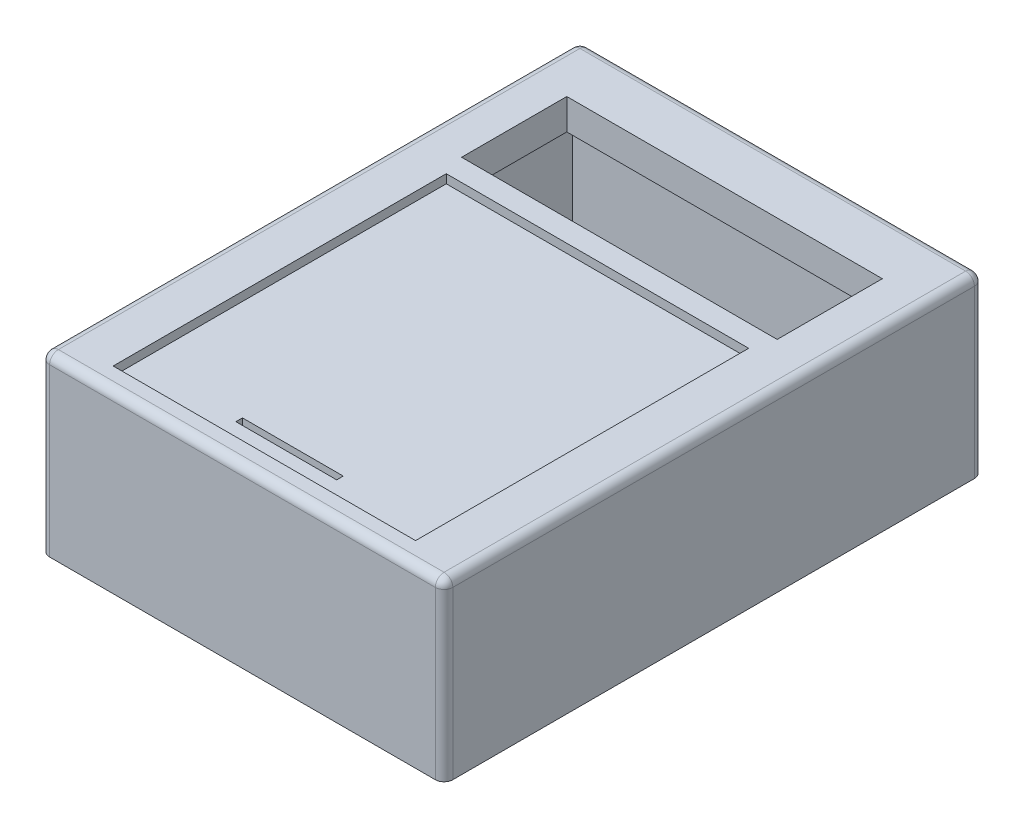
ISO-10303-21;
HEADER;
FILE_DESCRIPTION(('STEP AP214'),'2;1');
FILE_NAME('part.step','',(''),(''),'','','');
FILE_SCHEMA(('AUTOMOTIVE_DESIGN { 1 0 10303 214 1 1 1 1 }'));
ENDSEC;
DATA;
#1=APPLICATION_CONTEXT('core data for automotive mechanical design processes');
#2=APPLICATION_PROTOCOL_DEFINITION('international standard','automotive_design',2000,#1);
#3=PRODUCT_CONTEXT('',#1,'mechanical');
#4=PRODUCT('Part','Part','',(#3));
#5=PRODUCT_RELATED_PRODUCT_CATEGORY('part','',(#4));
#6=PRODUCT_DEFINITION_FORMATION('','',#4);
#7=PRODUCT_DEFINITION_CONTEXT('part definition',#1,'design');
#8=PRODUCT_DEFINITION('design','',#6,#7);
#9=PRODUCT_DEFINITION_SHAPE('','',#8);
#10=(LENGTH_UNIT() NAMED_UNIT(*) SI_UNIT(.MILLI.,.METRE.));
#11=(NAMED_UNIT(*) PLANE_ANGLE_UNIT() SI_UNIT($,.RADIAN.));
#12=(NAMED_UNIT(*) SI_UNIT($,.STERADIAN.) SOLID_ANGLE_UNIT());
#13=UNCERTAINTY_MEASURE_WITH_UNIT(LENGTH_MEASURE(1.E-05),#10,'distance_accuracy_value','');
#14=(GEOMETRIC_REPRESENTATION_CONTEXT(3) GLOBAL_UNCERTAINTY_ASSIGNED_CONTEXT((#13)) GLOBAL_UNIT_ASSIGNED_CONTEXT((#10,
#11,#12)) REPRESENTATION_CONTEXT('',''));
#15=CARTESIAN_POINT('',(0.,0.,0.));
#16=DIRECTION('',(0.,0.,1.));
#17=DIRECTION('',(1.,0.,0.));
#18=AXIS2_PLACEMENT_3D('',#15,#16,#17);
#19=CARTESIAN_POINT('',(9.99999999999999,0.,-110.));
#20=DIRECTION('',(-1.,0.,0.));
#21=DIRECTION('',(0.,0.,1.));
#22=AXIS2_PLACEMENT_3D('',#19,#20,#21);
#23=PLANE('',#22);
#24=DIRECTION('',(0.,0.,1.));
#25=VECTOR('',#24,1.);
#26=CARTESIAN_POINT('',(9.99999999999999,33.,-110.));
#27=LINE('',#26,#25);
#28=CARTESIAN_POINT('',(9.99999999999999,33.,-110.));
#29=VERTEX_POINT('',#28);
#30=CARTESIAN_POINT('',(10.,33.,-86.));
#31=VERTEX_POINT('',#30);
#32=EDGE_CURVE('E62',#29,#31,#27,.T.);
#33=ORIENTED_EDGE('',*,*,#32,.F.);
#34=DIRECTION('',(0.,1.,0.));
#35=VECTOR('',#34,1.);
#36=CARTESIAN_POINT('',(9.99999999999999,0.,-110.));
#37=LINE('',#36,#35);
#38=CARTESIAN_POINT('',(9.99999999999999,40.,-110.));
#39=VERTEX_POINT('',#38);
#40=EDGE_CURVE('E329',#29,#39,#37,.T.);
#41=ORIENTED_EDGE('',*,*,#40,.T.);
#42=DIRECTION('',(0.,0.,1.));
#43=VECTOR('',#42,1.);
#44=CARTESIAN_POINT('',(9.99999999999999,40.,-110.));
#45=LINE('',#44,#43);
#46=CARTESIAN_POINT('',(10.,40.,-86.));
#47=VERTEX_POINT('',#46);
#48=EDGE_CURVE('E310',#39,#47,#45,.T.);
#49=ORIENTED_EDGE('',*,*,#48,.T.);
#50=DIRECTION('',(0.,1.,0.));
#51=VECTOR('',#50,1.);
#52=CARTESIAN_POINT('',(10.,0.,-86.));
#53=LINE('',#52,#51);
#54=EDGE_CURVE('E328',#31,#47,#53,.T.);
#55=ORIENTED_EDGE('',*,*,#54,.F.);
#56=EDGE_LOOP('',(#33,#41,#49,#55));
#57=FACE_BOUND('',#56,.T.);
#58=ADVANCED_FACE('F39',(#57),#23,.F.);
#59=CARTESIAN_POINT('',(9.99999999999999,0.,-110.));
#60=DIRECTION('',(0.,0.,-1.));
#61=DIRECTION('',(-1.,0.,0.));
#62=AXIS2_PLACEMENT_3D('',#59,#60,#61);
#63=PLANE('',#62);
#64=DIRECTION('',(-1.,0.,0.));
#65=VECTOR('',#64,1.);
#66=CARTESIAN_POINT('',(9.99999999999999,33.,-110.));
#67=LINE('',#66,#65);
#68=CARTESIAN_POINT('',(82.,33.,-110.));
#69=VERTEX_POINT('',#68);
#70=EDGE_CURVE('E259',#69,#29,#67,.T.);
#71=ORIENTED_EDGE('',*,*,#70,.F.);
#72=DIRECTION('',(0.,1.,0.));
#73=VECTOR('',#72,1.);
#74=CARTESIAN_POINT('',(82.,0.,-110.));
#75=LINE('',#74,#73);
#76=CARTESIAN_POINT('',(82.,40.,-110.));
#77=VERTEX_POINT('',#76);
#78=EDGE_CURVE('E332',#69,#77,#75,.T.);
#79=ORIENTED_EDGE('',*,*,#78,.T.);
#80=DIRECTION('',(-1.,0.,0.));
#81=VECTOR('',#80,1.);
#82=CARTESIAN_POINT('',(9.99999999999999,40.,-110.));
#83=LINE('',#82,#81);
#84=EDGE_CURVE('E325',#77,#39,#83,.T.);
#85=ORIENTED_EDGE('',*,*,#84,.T.);
#86=ORIENTED_EDGE('',*,*,#40,.F.);
#87=EDGE_LOOP('',(#71,#79,#85,#86));
#88=FACE_BOUND('',#87,.T.);
#89=ADVANCED_FACE('F500',(#88),#63,.F.);
#90=CARTESIAN_POINT('',(82.,0.,-110.));
#91=DIRECTION('',(1.,0.,0.));
#92=DIRECTION('',(0.,0.,-1.));
#93=AXIS2_PLACEMENT_3D('',#90,#91,#92);
#94=PLANE('',#93);
#95=DIRECTION('',(0.,0.,-1.));
#96=VECTOR('',#95,1.);
#97=CARTESIAN_POINT('',(82.,33.,-110.));
#98=LINE('',#97,#96);
#99=CARTESIAN_POINT('',(82.,33.,-86.));
#100=VERTEX_POINT('',#99);
#101=EDGE_CURVE('E257',#100,#69,#98,.T.);
#102=ORIENTED_EDGE('',*,*,#101,.F.);
#103=DIRECTION('',(0.,1.,0.));
#104=VECTOR('',#103,1.);
#105=CARTESIAN_POINT('',(82.,0.,-86.));
#106=LINE('',#105,#104);
#107=CARTESIAN_POINT('',(82.,40.,-86.));
#108=VERTEX_POINT('',#107);
#109=EDGE_CURVE('E334',#100,#108,#106,.T.);
#110=ORIENTED_EDGE('',*,*,#109,.T.);
#111=DIRECTION('',(0.,0.,-1.));
#112=VECTOR('',#111,1.);
#113=CARTESIAN_POINT('',(82.,40.,-110.));
#114=LINE('',#113,#112);
#115=EDGE_CURVE('E322',#108,#77,#114,.T.);
#116=ORIENTED_EDGE('',*,*,#115,.T.);
#117=ORIENTED_EDGE('',*,*,#78,.F.);
#118=EDGE_LOOP('',(#102,#110,#116,#117));
#119=FACE_BOUND('',#118,.T.);
#120=ADVANCED_FACE('F506',(#119),#94,.F.);
#121=CARTESIAN_POINT('',(10.,0.,-86.));
#122=DIRECTION('',(0.,0.,1.));
#123=DIRECTION('',(1.,0.,0.));
#124=AXIS2_PLACEMENT_3D('',#121,#122,#123);
#125=PLANE('',#124);
#126=DIRECTION('',(1.,0.,0.));
#127=VECTOR('',#126,1.);
#128=CARTESIAN_POINT('',(10.,33.,-86.));
#129=LINE('',#128,#127);
#130=EDGE_CURVE('E255',#31,#100,#129,.T.);
#131=ORIENTED_EDGE('',*,*,#130,.F.);
#132=ORIENTED_EDGE('',*,*,#54,.T.);
#133=DIRECTION('',(1.,0.,0.));
#134=VECTOR('',#133,1.);
#135=CARTESIAN_POINT('',(10.,40.,-86.));
#136=LINE('',#135,#134);
#137=EDGE_CURVE('E319',#47,#108,#136,.T.);
#138=ORIENTED_EDGE('',*,*,#137,.T.);
#139=ORIENTED_EDGE('',*,*,#109,.F.);
#140=EDGE_LOOP('',(#131,#132,#138,#139));
#141=FACE_BOUND('',#140,.T.);
#142=ADVANCED_FACE('F511',(#141),#125,.F.);
#143=CARTESIAN_POINT('',(34.5,0.,-11.5));
#144=DIRECTION('',(-1.,0.,0.));
#145=DIRECTION('',(0.,0.,1.));
#146=AXIS2_PLACEMENT_3D('',#143,#144,#145);
#147=PLANE('',#146);
#148=DIRECTION('',(0.,0.,1.));
#149=VECTOR('',#148,1.);
#150=CARTESIAN_POINT('',(34.5,33.,-11.5));
#151=LINE('',#150,#149);
#152=CARTESIAN_POINT('',(34.5,33.,-11.5));
#153=VERTEX_POINT('',#152);
#154=CARTESIAN_POINT('',(34.5,33.,-9.99999999999999));
#155=VERTEX_POINT('',#154);
#156=EDGE_CURVE('E253',#153,#155,#151,.T.);
#157=ORIENTED_EDGE('',*,*,#156,.F.);
#158=DIRECTION('',(0.,1.,0.));
#159=VECTOR('',#158,1.);
#160=CARTESIAN_POINT('',(34.5,0.,-11.5));
#161=LINE('',#160,#159);
#162=CARTESIAN_POINT('',(34.5,38.,-11.5));
#163=VERTEX_POINT('',#162);
#164=EDGE_CURVE('E277',#153,#163,#161,.T.);
#165=ORIENTED_EDGE('',*,*,#164,.T.);
#166=DIRECTION('',(0.,0.,1.));
#167=VECTOR('',#166,1.);
#168=CARTESIAN_POINT('',(34.5,38.,-11.5));
#169=LINE('',#168,#167);
#170=CARTESIAN_POINT('',(34.5,38.,-9.99999999999999));
#171=VERTEX_POINT('',#170);
#172=EDGE_CURVE('E263',#163,#171,#169,.T.);
#173=ORIENTED_EDGE('',*,*,#172,.T.);
#174=DIRECTION('',(0.,1.,0.));
#175=VECTOR('',#174,1.);
#176=CARTESIAN_POINT('',(34.5,0.,-9.99999999999999));
#177=LINE('',#176,#175);
#178=EDGE_CURVE('E276',#155,#171,#177,.T.);
#179=ORIENTED_EDGE('',*,*,#178,.F.);
#180=EDGE_LOOP('',(#157,#165,#173,#179));
#181=FACE_BOUND('',#180,.T.);
#182=ADVANCED_FACE('F546',(#181),#147,.F.);
#183=CARTESIAN_POINT('',(34.5,0.,-11.5));
#184=DIRECTION('',(0.,0.,-1.));
#185=DIRECTION('',(-1.,0.,0.));
#186=AXIS2_PLACEMENT_3D('',#183,#184,#185);
#187=PLANE('',#186);
#188=DIRECTION('',(-1.,0.,0.));
#189=VECTOR('',#188,1.);
#190=CARTESIAN_POINT('',(34.5,33.,-11.5));
#191=LINE('',#190,#189);
#192=CARTESIAN_POINT('',(57.5,33.,-11.5));
#193=VERTEX_POINT('',#192);
#194=EDGE_CURVE('E251',#193,#153,#191,.T.);
#195=ORIENTED_EDGE('',*,*,#194,.F.);
#196=DIRECTION('',(0.,1.,0.));
#197=VECTOR('',#196,1.);
#198=CARTESIAN_POINT('',(57.5,0.,-11.5));
#199=LINE('',#198,#197);
#200=CARTESIAN_POINT('',(57.5,38.,-11.5));
#201=VERTEX_POINT('',#200);
#202=EDGE_CURVE('E280',#193,#201,#199,.T.);
#203=ORIENTED_EDGE('',*,*,#202,.T.);
#204=DIRECTION('',(-1.,0.,0.));
#205=VECTOR('',#204,1.);
#206=CARTESIAN_POINT('',(34.5,38.,-11.5));
#207=LINE('',#206,#205);
#208=EDGE_CURVE('E273',#201,#163,#207,.T.);
#209=ORIENTED_EDGE('',*,*,#208,.T.);
#210=ORIENTED_EDGE('',*,*,#164,.F.);
#211=EDGE_LOOP('',(#195,#203,#209,#210));
#212=FACE_BOUND('',#211,.T.);
#213=ADVANCED_FACE('F542',(#212),#187,.F.);
#214=CARTESIAN_POINT('',(57.5,0.,-11.5));
#215=DIRECTION('',(1.,0.,0.));
#216=DIRECTION('',(0.,0.,-1.));
#217=AXIS2_PLACEMENT_3D('',#214,#215,#216);
#218=PLANE('',#217);
#219=DIRECTION('',(0.,0.,-1.));
#220=VECTOR('',#219,1.);
#221=CARTESIAN_POINT('',(57.5,33.,-11.5));
#222=LINE('',#221,#220);
#223=CARTESIAN_POINT('',(57.5,33.,-9.99999999999999));
#224=VERTEX_POINT('',#223);
#225=EDGE_CURVE('E246',#224,#193,#222,.T.);
#226=ORIENTED_EDGE('',*,*,#225,.F.);
#227=DIRECTION('',(0.,1.,0.));
#228=VECTOR('',#227,1.);
#229=CARTESIAN_POINT('',(57.5,0.,-9.99999999999999));
#230=LINE('',#229,#228);
#231=CARTESIAN_POINT('',(57.5,38.,-9.99999999999999));
#232=VERTEX_POINT('',#231);
#233=EDGE_CURVE('E282',#224,#232,#230,.T.);
#234=ORIENTED_EDGE('',*,*,#233,.T.);
#235=DIRECTION('',(0.,0.,-1.));
#236=VECTOR('',#235,1.);
#237=CARTESIAN_POINT('',(57.5,38.,-11.5));
#238=LINE('',#237,#236);
#239=EDGE_CURVE('E270',#232,#201,#238,.T.);
#240=ORIENTED_EDGE('',*,*,#239,.T.);
#241=ORIENTED_EDGE('',*,*,#202,.F.);
#242=EDGE_LOOP('',(#226,#234,#240,#241));
#243=FACE_BOUND('',#242,.T.);
#244=ADVANCED_FACE('F545',(#243),#218,.F.);
#245=CARTESIAN_POINT('',(34.5,0.,-9.99999999999999));
#246=DIRECTION('',(0.,0.,1.));
#247=DIRECTION('',(1.,0.,0.));
#248=AXIS2_PLACEMENT_3D('',#245,#246,#247);
#249=PLANE('',#248);
#250=DIRECTION('',(1.,0.,0.));
#251=VECTOR('',#250,1.);
#252=CARTESIAN_POINT('',(34.5,33.,-9.99999999999999));
#253=LINE('',#252,#251);
#254=EDGE_CURVE('E11',#155,#224,#253,.T.);
#255=ORIENTED_EDGE('',*,*,#254,.F.);
#256=ORIENTED_EDGE('',*,*,#178,.T.);
#257=DIRECTION('',(1.,0.,0.));
#258=VECTOR('',#257,1.);
#259=CARTESIAN_POINT('',(34.5,38.,-9.99999999999999));
#260=LINE('',#259,#258);
#261=EDGE_CURVE('E266',#171,#232,#260,.T.);
#262=ORIENTED_EDGE('',*,*,#261,.T.);
#263=ORIENTED_EDGE('',*,*,#233,.F.);
#264=EDGE_LOOP('',(#255,#256,#262,#263));
#265=FACE_BOUND('',#264,.T.);
#266=ADVANCED_FACE('F550',(#265),#249,.F.);
#267=CARTESIAN_POINT('',(0.,40.,0.));
#268=DIRECTION('',(1.,0.,0.));
#269=DIRECTION('',(0.,0.,-1.));
#270=AXIS2_PLACEMENT_3D('',#267,#268,#269);
#271=PLANE('',#270);
#272=DIRECTION('',(0.,0.,1.));
#273=VECTOR('',#272,1.);
#274=CARTESIAN_POINT('',(0.,38.,0.));
#275=LINE('',#274,#273);
#276=CARTESIAN_POINT('',(0.,38.,-2.));
#277=VERTEX_POINT('',#276);
#278=CARTESIAN_POINT('',(0.,38.,-121.));
#279=VERTEX_POINT('',#278);
#280=EDGE_CURVE('E369',#277,#279,#275,.F.);
#281=ORIENTED_EDGE('',*,*,#280,.T.);
#282=DIRECTION('',(0.,-1.,0.));
#283=VECTOR('',#282,1.);
#284=CARTESIAN_POINT('',(0.,40.,-121.));
#285=LINE('',#284,#283);
#286=CARTESIAN_POINT('',(0.,0.,-121.));
#287=VERTEX_POINT('',#286);
#288=EDGE_CURVE('E373',#279,#287,#285,.T.);
#289=ORIENTED_EDGE('',*,*,#288,.T.);
#290=DIRECTION('',(0.,0.,1.));
#291=VECTOR('',#290,1.);
#292=CARTESIAN_POINT('',(0.,0.,0.));
#293=LINE('',#292,#291);
#294=CARTESIAN_POINT('',(0.,0.,-2.));
#295=VERTEX_POINT('',#294);
#296=EDGE_CURVE('E331',#287,#295,#293,.T.);
#297=ORIENTED_EDGE('',*,*,#296,.T.);
#298=DIRECTION('',(0.,-1.,0.));
#299=VECTOR('',#298,1.);
#300=CARTESIAN_POINT('',(0.,40.,-2.));
#301=LINE('',#300,#299);
#302=EDGE_CURVE('E371',#295,#277,#301,.F.);
#303=ORIENTED_EDGE('',*,*,#302,.T.);
#304=EDGE_LOOP('',(#281,#289,#297,#303));
#305=FACE_BOUND('',#304,.T.);
#306=ADVANCED_FACE('F466',(#305),#271,.F.);
#307=CARTESIAN_POINT('',(0.,40.,0.));
#308=DIRECTION('',(0.,0.,-1.));
#309=DIRECTION('',(-1.,0.,0.));
#310=AXIS2_PLACEMENT_3D('',#307,#308,#309);
#311=PLANE('',#310);
#312=DIRECTION('',(1.,0.,0.));
#313=VECTOR('',#312,1.);
#314=CARTESIAN_POINT('',(0.,38.,0.));
#315=LINE('',#314,#313);
#316=CARTESIAN_POINT('',(90.,38.,0.));
#317=VERTEX_POINT('',#316);
#318=CARTESIAN_POINT('',(2.,38.,0.));
#319=VERTEX_POINT('',#318);
#320=EDGE_CURVE('E375',#317,#319,#315,.F.);
#321=ORIENTED_EDGE('',*,*,#320,.T.);
#322=DIRECTION('',(0.,-1.,0.));
#323=VECTOR('',#322,1.);
#324=CARTESIAN_POINT('',(2.,40.,0.));
#325=LINE('',#324,#323);
#326=CARTESIAN_POINT('',(2.,0.,0.));
#327=VERTEX_POINT('',#326);
#328=EDGE_CURVE('E379',#319,#327,#325,.T.);
#329=ORIENTED_EDGE('',*,*,#328,.T.);
#330=DIRECTION('',(1.,0.,0.));
#331=VECTOR('',#330,1.);
#332=CARTESIAN_POINT('',(0.,0.,0.));
#333=LINE('',#332,#331);
#334=CARTESIAN_POINT('',(90.,0.,0.));
#335=VERTEX_POINT('',#334);
#336=EDGE_CURVE('E339',#327,#335,#333,.T.);
#337=ORIENTED_EDGE('',*,*,#336,.T.);
#338=DIRECTION('',(0.,-1.,0.));
#339=VECTOR('',#338,1.);
#340=CARTESIAN_POINT('',(90.,40.,0.));
#341=LINE('',#340,#339);
#342=EDGE_CURVE('E377',#335,#317,#341,.F.);
#343=ORIENTED_EDGE('',*,*,#342,.T.);
#344=EDGE_LOOP('',(#321,#329,#337,#343));
#345=FACE_BOUND('',#344,.T.);
#346=ADVANCED_FACE('F472',(#345),#311,.F.);
#347=CARTESIAN_POINT('',(92.,40.,0.));
#348=DIRECTION('',(-1.,0.,0.));
#349=DIRECTION('',(0.,0.,1.));
#350=AXIS2_PLACEMENT_3D('',#347,#348,#349);
#351=PLANE('',#350);
#352=DIRECTION('',(0.,0.,-1.));
#353=VECTOR('',#352,1.);
#354=CARTESIAN_POINT('',(92.,0.,0.));
#355=LINE('',#354,#353);
#356=CARTESIAN_POINT('',(92.,0.,-2.));
#357=VERTEX_POINT('',#356);
#358=CARTESIAN_POINT('',(92.,0.,-121.));
#359=VERTEX_POINT('',#358);
#360=EDGE_CURVE('E342',#357,#359,#355,.T.);
#361=ORIENTED_EDGE('',*,*,#360,.T.);
#362=DIRECTION('',(0.,-1.,0.));
#363=VECTOR('',#362,1.);
#364=CARTESIAN_POINT('',(92.,40.,-121.));
#365=LINE('',#364,#363);
#366=CARTESIAN_POINT('',(92.,38.,-121.));
#367=VERTEX_POINT('',#366);
#368=EDGE_CURVE('E367',#359,#367,#365,.F.);
#369=ORIENTED_EDGE('',*,*,#368,.T.);
#370=DIRECTION('',(0.,0.,-1.));
#371=VECTOR('',#370,1.);
#372=CARTESIAN_POINT('',(92.,38.,0.));
#373=LINE('',#372,#371);
#374=CARTESIAN_POINT('',(92.,38.,-2.));
#375=VERTEX_POINT('',#374);
#376=EDGE_CURVE('E363',#367,#375,#373,.F.);
#377=ORIENTED_EDGE('',*,*,#376,.T.);
#378=DIRECTION('',(0.,-1.,0.));
#379=VECTOR('',#378,1.);
#380=CARTESIAN_POINT('',(92.,40.,-2.));
#381=LINE('',#380,#379);
#382=EDGE_CURVE('E365',#375,#357,#381,.T.);
#383=ORIENTED_EDGE('',*,*,#382,.T.);
#384=EDGE_LOOP('',(#361,#369,#377,#383));
#385=FACE_BOUND('',#384,.T.);
#386=ADVANCED_FACE('F490',(#385),#351,.F.);
#387=CARTESIAN_POINT('',(0.,40.,-123.));
#388=DIRECTION('',(0.,0.,1.));
#389=DIRECTION('',(1.,0.,0.));
#390=AXIS2_PLACEMENT_3D('',#387,#388,#389);
#391=PLANE('',#390);
#392=DIRECTION('',(-1.,0.,0.));
#393=VECTOR('',#392,1.);
#394=CARTESIAN_POINT('',(0.,38.,-123.));
#395=LINE('',#394,#393);
#396=CARTESIAN_POINT('',(2.,38.,-123.));
#397=VERTEX_POINT('',#396);
#398=CARTESIAN_POINT('',(90.,38.,-123.));
#399=VERTEX_POINT('',#398);
#400=EDGE_CURVE('E348',#397,#399,#395,.F.);
#401=ORIENTED_EDGE('',*,*,#400,.T.);
#402=DIRECTION('',(0.,-1.,0.));
#403=VECTOR('',#402,1.);
#404=CARTESIAN_POINT('',(90.,40.,-123.));
#405=LINE('',#404,#403);
#406=CARTESIAN_POINT('',(90.,0.,-123.));
#407=VERTEX_POINT('',#406);
#408=EDGE_CURVE('E352',#399,#407,#405,.T.);
#409=ORIENTED_EDGE('',*,*,#408,.T.);
#410=DIRECTION('',(-1.,0.,0.));
#411=VECTOR('',#410,1.);
#412=CARTESIAN_POINT('',(0.,0.,-123.));
#413=LINE('',#412,#411);
#414=CARTESIAN_POINT('',(2.,0.,-123.));
#415=VERTEX_POINT('',#414);
#416=EDGE_CURVE('E345',#407,#415,#413,.T.);
#417=ORIENTED_EDGE('',*,*,#416,.T.);
#418=DIRECTION('',(0.,-1.,0.));
#419=VECTOR('',#418,1.);
#420=CARTESIAN_POINT('',(2.,40.,-123.));
#421=LINE('',#420,#419);
#422=EDGE_CURVE('E350',#415,#397,#421,.F.);
#423=ORIENTED_EDGE('',*,*,#422,.T.);
#424=EDGE_LOOP('',(#401,#409,#417,#423));
#425=FACE_BOUND('',#424,.T.);
#426=ADVANCED_FACE('F456',(#425),#391,.F.);
#427=CARTESIAN_POINT('',(0.,40.,0.));
#428=DIRECTION('',(0.,-1.,0.));
#429=DIRECTION('',(0.,0.,-1.));
#430=AXIS2_PLACEMENT_3D('',#427,#428,#429);
#431=PLANE('',#430);
#432=DIRECTION('',(-1.,0.,0.));
#433=VECTOR('',#432,1.);
#434=CARTESIAN_POINT('',(0.,40.,-121.));
#435=LINE('',#434,#433);
#436=CARTESIAN_POINT('',(90.,40.,-121.));
#437=VERTEX_POINT('',#436);
#438=CARTESIAN_POINT('',(2.,40.,-121.));
#439=VERTEX_POINT('',#438);
#440=EDGE_CURVE('E385',#437,#439,#435,.T.);
#441=ORIENTED_EDGE('',*,*,#440,.T.);
#442=DIRECTION('',(0.,0.,1.));
#443=VECTOR('',#442,1.);
#444=CARTESIAN_POINT('',(2.,40.,0.));
#445=LINE('',#444,#443);
#446=CARTESIAN_POINT('',(2.,40.,-2.));
#447=VERTEX_POINT('',#446);
#448=EDGE_CURVE('E47',#439,#447,#445,.T.);
#449=ORIENTED_EDGE('',*,*,#448,.T.);
#450=DIRECTION('',(1.,0.,0.));
#451=VECTOR('',#450,1.);
#452=CARTESIAN_POINT('',(0.,40.,-2.));
#453=LINE('',#452,#451);
#454=CARTESIAN_POINT('',(90.,40.,-2.));
#455=VERTEX_POINT('',#454);
#456=EDGE_CURVE('E381',#447,#455,#453,.T.);
#457=ORIENTED_EDGE('',*,*,#456,.T.);
#458=DIRECTION('',(0.,0.,-1.));
#459=VECTOR('',#458,1.);
#460=CARTESIAN_POINT('',(90.,40.,0.));
#461=LINE('',#460,#459);
#462=EDGE_CURVE('E383',#455,#437,#461,.T.);
#463=ORIENTED_EDGE('',*,*,#462,.T.);
#464=EDGE_LOOP('',(#441,#449,#457,#463));
#465=FACE_BOUND('',#464,.T.);
#466=DIRECTION('',(1.,0.,0.));
#467=VECTOR('',#466,1.);
#468=CARTESIAN_POINT('',(11.5,40.,-4.99999999999999));
#469=LINE('',#468,#467);
#470=CARTESIAN_POINT('',(11.5,40.,-4.99999999999999));
#471=VERTEX_POINT('',#470);
#472=CARTESIAN_POINT('',(80.5,40.,-4.99999999999999));
#473=VERTEX_POINT('',#472);
#474=EDGE_CURVE('E300',#471,#473,#469,.T.);
#475=ORIENTED_EDGE('',*,*,#474,.F.);
#476=DIRECTION('',(0.,0.,1.));
#477=VECTOR('',#476,1.);
#478=CARTESIAN_POINT('',(11.5,40.,-81.));
#479=LINE('',#478,#477);
#480=CARTESIAN_POINT('',(11.5,40.,-81.));
#481=VERTEX_POINT('',#480);
#482=EDGE_CURVE('E279',#481,#471,#479,.T.);
#483=ORIENTED_EDGE('',*,*,#482,.F.);
#484=DIRECTION('',(-1.,0.,0.));
#485=VECTOR('',#484,1.);
#486=CARTESIAN_POINT('',(11.5,40.,-81.));
#487=LINE('',#486,#485);
#488=CARTESIAN_POINT('',(80.5,40.,-81.));
#489=VERTEX_POINT('',#488);
#490=EDGE_CURVE('E289',#489,#481,#487,.T.);
#491=ORIENTED_EDGE('',*,*,#490,.F.);
#492=DIRECTION('',(0.,0.,-1.));
#493=VECTOR('',#492,1.);
#494=CARTESIAN_POINT('',(80.5,40.,-81.));
#495=LINE('',#494,#493);
#496=EDGE_CURVE('E303',#473,#489,#495,.T.);
#497=ORIENTED_EDGE('',*,*,#496,.F.);
#498=EDGE_LOOP('',(#475,#483,#491,#497));
#499=FACE_BOUND('',#498,.T.);
#500=ORIENTED_EDGE('',*,*,#137,.F.);
#501=ORIENTED_EDGE('',*,*,#48,.F.);
#502=ORIENTED_EDGE('',*,*,#84,.F.);
#503=ORIENTED_EDGE('',*,*,#115,.F.);
#504=EDGE_LOOP('',(#500,#501,#502,#503));
#505=FACE_BOUND('',#504,.T.);
#506=ADVANCED_FACE('F437',(#465,#499,#505),#431,.F.);
#507=CARTESIAN_POINT('',(0.,0.,0.));
#508=DIRECTION('',(0.,-1.,0.));
#509=DIRECTION('',(0.,0.,-1.));
#510=AXIS2_PLACEMENT_3D('',#507,#508,#509);
#511=PLANE('',#510);
#512=DIRECTION('',(0.,0.,1.));
#513=VECTOR('',#512,1.);
#514=CARTESIAN_POINT('',(87.6988324780761,0.,-117.408586003346));
#515=LINE('',#514,#513);
#516=CARTESIAN_POINT('',(87.6988324780761,0.,-117.408586003346));
#517=VERTEX_POINT('',#516);
#518=CARTESIAN_POINT('',(87.6988324780761,0.,-6.92542873170209));
#519=VERTEX_POINT('',#518);
#520=EDGE_CURVE('E54',#517,#519,#515,.T.);
#521=ORIENTED_EDGE('',*,*,#520,.F.);
#522=DIRECTION('',(1.,0.,0.));
#523=VECTOR('',#522,1.);
#524=CARTESIAN_POINT('',(87.6988324780761,0.,-117.408586003346));
#525=LINE('',#524,#523);
#526=CARTESIAN_POINT('',(3.87574141763311,0.,-117.408586003346));
#527=VERTEX_POINT('',#526);
#528=EDGE_CURVE('E231',#527,#517,#525,.T.);
#529=ORIENTED_EDGE('',*,*,#528,.F.);
#530=DIRECTION('',(0.,0.,-1.));
#531=VECTOR('',#530,1.);
#532=CARTESIAN_POINT('',(3.87574141763311,0.,-117.408586003346));
#533=LINE('',#532,#531);
#534=CARTESIAN_POINT('',(3.87574141763311,0.,-6.92542873170209));
#535=VERTEX_POINT('',#534);
#536=EDGE_CURVE('E234',#535,#527,#533,.T.);
#537=ORIENTED_EDGE('',*,*,#536,.F.);
#538=DIRECTION('',(-1.,0.,0.));
#539=VECTOR('',#538,1.);
#540=CARTESIAN_POINT('',(87.6988324780761,0.,-6.92542873170209));
#541=LINE('',#540,#539);
#542=EDGE_CURVE('E240',#519,#535,#541,.T.);
#543=ORIENTED_EDGE('',*,*,#542,.F.);
#544=EDGE_LOOP('',(#521,#529,#537,#543));
#545=FACE_BOUND('',#544,.T.);
#546=ORIENTED_EDGE('',*,*,#416,.F.);
#547=CARTESIAN_POINT('',(90.,0.,-121.));
#548=DIRECTION('',(0.,-1.,0.));
#549=DIRECTION('',(0.,0.,-1.));
#550=AXIS2_PLACEMENT_3D('',#547,#548,#549);
#551=CIRCLE('',#550,2.);
#552=EDGE_CURVE('E361',#407,#359,#551,.T.);
#553=ORIENTED_EDGE('',*,*,#552,.T.);
#554=ORIENTED_EDGE('',*,*,#360,.F.);
#555=CARTESIAN_POINT('',(90.,0.,-2.));
#556=DIRECTION('',(0.,-1.,0.));
#557=DIRECTION('',(0.,0.,-1.));
#558=AXIS2_PLACEMENT_3D('',#555,#556,#557);
#559=CIRCLE('',#558,2.);
#560=EDGE_CURVE('E355',#357,#335,#559,.T.);
#561=ORIENTED_EDGE('',*,*,#560,.T.);
#562=ORIENTED_EDGE('',*,*,#336,.F.);
#563=CARTESIAN_POINT('',(2.,0.,-2.));
#564=DIRECTION('',(0.,-1.,0.));
#565=DIRECTION('',(0.,0.,-1.));
#566=AXIS2_PLACEMENT_3D('',#563,#564,#565);
#567=CIRCLE('',#566,2.);
#568=EDGE_CURVE('E357',#327,#295,#567,.T.);
#569=ORIENTED_EDGE('',*,*,#568,.T.);
#570=ORIENTED_EDGE('',*,*,#296,.F.);
#571=CARTESIAN_POINT('',(2.,0.,-121.));
#572=DIRECTION('',(0.,-1.,0.));
#573=DIRECTION('',(0.,0.,-1.));
#574=AXIS2_PLACEMENT_3D('',#571,#572,#573);
#575=CIRCLE('',#574,2.);
#576=EDGE_CURVE('E359',#287,#415,#575,.T.);
#577=ORIENTED_EDGE('',*,*,#576,.T.);
#578=EDGE_LOOP('',(#546,#553,#554,#561,#562,#569,#570,#577));
#579=FACE_BOUND('',#578,.T.);
#580=ADVANCED_FACE('F468',(#545,#579),#511,.T.);
#581=CARTESIAN_POINT('',(11.5,38.,-81.));
#582=DIRECTION('',(-1.,0.,0.));
#583=DIRECTION('',(0.,0.,1.));
#584=AXIS2_PLACEMENT_3D('',#581,#582,#583);
#585=PLANE('',#584);
#586=ORIENTED_EDGE('',*,*,#482,.T.);
#587=DIRECTION('',(0.,1.,0.));
#588=VECTOR('',#587,1.);
#589=CARTESIAN_POINT('',(11.5,38.,-4.99999999999999));
#590=LINE('',#589,#588);
#591=CARTESIAN_POINT('',(11.5,38.,-4.99999999999999));
#592=VERTEX_POINT('',#591);
#593=EDGE_CURVE('E298',#592,#471,#590,.T.);
#594=ORIENTED_EDGE('',*,*,#593,.F.);
#595=DIRECTION('',(0.,0.,1.));
#596=VECTOR('',#595,1.);
#597=CARTESIAN_POINT('',(11.5,38.,-81.));
#598=LINE('',#597,#596);
#599=CARTESIAN_POINT('',(11.5,38.,-81.));
#600=VERTEX_POINT('',#599);
#601=EDGE_CURVE('E285',#600,#592,#598,.T.);
#602=ORIENTED_EDGE('',*,*,#601,.F.);
#603=DIRECTION('',(0.,1.,0.));
#604=VECTOR('',#603,1.);
#605=CARTESIAN_POINT('',(11.5,38.,-81.));
#606=LINE('',#605,#604);
#607=EDGE_CURVE('E308',#600,#481,#606,.T.);
#608=ORIENTED_EDGE('',*,*,#607,.T.);
#609=EDGE_LOOP('',(#586,#594,#602,#608));
#610=FACE_BOUND('',#609,.T.);
#611=ADVANCED_FACE('F516',(#610),#585,.F.);
#612=CARTESIAN_POINT('',(11.5,38.,-81.));
#613=DIRECTION('',(0.,0.,-1.));
#614=DIRECTION('',(-1.,0.,0.));
#615=AXIS2_PLACEMENT_3D('',#612,#613,#614);
#616=PLANE('',#615);
#617=ORIENTED_EDGE('',*,*,#490,.T.);
#618=ORIENTED_EDGE('',*,*,#607,.F.);
#619=DIRECTION('',(-1.,0.,0.));
#620=VECTOR('',#619,1.);
#621=CARTESIAN_POINT('',(11.5,38.,-81.));
#622=LINE('',#621,#620);
#623=CARTESIAN_POINT('',(80.5,38.,-81.));
#624=VERTEX_POINT('',#623);
#625=EDGE_CURVE('E295',#624,#600,#622,.T.);
#626=ORIENTED_EDGE('',*,*,#625,.F.);
#627=DIRECTION('',(0.,1.,0.));
#628=VECTOR('',#627,1.);
#629=CARTESIAN_POINT('',(80.5,38.,-81.));
#630=LINE('',#629,#628);
#631=EDGE_CURVE('E311',#624,#489,#630,.T.);
#632=ORIENTED_EDGE('',*,*,#631,.T.);
#633=EDGE_LOOP('',(#617,#618,#626,#632));
#634=FACE_BOUND('',#633,.T.);
#635=ADVANCED_FACE('F521',(#634),#616,.F.);
#636=CARTESIAN_POINT('',(80.5,38.,-81.));
#637=DIRECTION('',(1.,0.,0.));
#638=DIRECTION('',(0.,0.,-1.));
#639=AXIS2_PLACEMENT_3D('',#636,#637,#638);
#640=PLANE('',#639);
#641=ORIENTED_EDGE('',*,*,#496,.T.);
#642=ORIENTED_EDGE('',*,*,#631,.F.);
#643=DIRECTION('',(0.,0.,-1.));
#644=VECTOR('',#643,1.);
#645=CARTESIAN_POINT('',(80.5,38.,-81.));
#646=LINE('',#645,#644);
#647=CARTESIAN_POINT('',(80.5,38.,-4.99999999999999));
#648=VERTEX_POINT('',#647);
#649=EDGE_CURVE('E292',#648,#624,#646,.T.);
#650=ORIENTED_EDGE('',*,*,#649,.F.);
#651=DIRECTION('',(0.,1.,0.));
#652=VECTOR('',#651,1.);
#653=CARTESIAN_POINT('',(80.5,38.,-4.99999999999999));
#654=LINE('',#653,#652);
#655=EDGE_CURVE('E313',#648,#473,#654,.T.);
#656=ORIENTED_EDGE('',*,*,#655,.T.);
#657=EDGE_LOOP('',(#641,#642,#650,#656));
#658=FACE_BOUND('',#657,.T.);
#659=ADVANCED_FACE('F565',(#658),#640,.F.);
#660=CARTESIAN_POINT('',(11.5,38.,-4.99999999999999));
#661=DIRECTION('',(0.,0.,1.));
#662=DIRECTION('',(1.,0.,0.));
#663=AXIS2_PLACEMENT_3D('',#660,#661,#662);
#664=PLANE('',#663);
#665=ORIENTED_EDGE('',*,*,#474,.T.);
#666=ORIENTED_EDGE('',*,*,#655,.F.);
#667=DIRECTION('',(1.,0.,0.));
#668=VECTOR('',#667,1.);
#669=CARTESIAN_POINT('',(11.5,38.,-4.99999999999999));
#670=LINE('',#669,#668);
#671=EDGE_CURVE('E288',#592,#648,#670,.T.);
#672=ORIENTED_EDGE('',*,*,#671,.F.);
#673=ORIENTED_EDGE('',*,*,#593,.T.);
#674=EDGE_LOOP('',(#665,#666,#672,#673));
#675=FACE_BOUND('',#674,.T.);
#676=ADVANCED_FACE('F561',(#675),#664,.F.);
#677=CARTESIAN_POINT('',(0.,38.,0.));
#678=DIRECTION('',(0.,1.,0.));
#679=DIRECTION('',(0.,0.,1.));
#680=AXIS2_PLACEMENT_3D('',#677,#678,#679);
#681=PLANE('',#680);
#682=ORIENTED_EDGE('',*,*,#172,.F.);
#683=ORIENTED_EDGE('',*,*,#208,.F.);
#684=ORIENTED_EDGE('',*,*,#239,.F.);
#685=ORIENTED_EDGE('',*,*,#261,.F.);
#686=EDGE_LOOP('',(#682,#683,#684,#685));
#687=FACE_BOUND('',#686,.T.);
#688=ORIENTED_EDGE('',*,*,#601,.T.);
#689=ORIENTED_EDGE('',*,*,#671,.T.);
#690=ORIENTED_EDGE('',*,*,#649,.T.);
#691=ORIENTED_EDGE('',*,*,#625,.T.);
#692=EDGE_LOOP('',(#688,#689,#690,#691));
#693=FACE_BOUND('',#692,.T.);
#694=ADVANCED_FACE('F558',(#687,#693),#681,.T.);
#695=CARTESIAN_POINT('',(2.,40.,-2.));
#696=DIRECTION('',(0.,-1.,0.));
#697=DIRECTION('',(0.,0.,-1.));
#698=AXIS2_PLACEMENT_3D('',#695,#696,#697);
#699=CYLINDRICAL_SURFACE('',#698,2.);
#700=CARTESIAN_POINT('',(2.,38.,-2.));
#701=DIRECTION('',(0.,1.,0.));
#702=DIRECTION('',(0.,0.,1.));
#703=AXIS2_PLACEMENT_3D('',#700,#701,#702);
#704=CIRCLE('',#703,2.);
#705=EDGE_CURVE('E267',#277,#319,#704,.T.);
#706=ORIENTED_EDGE('',*,*,#705,.F.);
#707=ORIENTED_EDGE('',*,*,#302,.F.);
#708=ORIENTED_EDGE('',*,*,#568,.F.);
#709=ORIENTED_EDGE('',*,*,#328,.F.);
#710=EDGE_LOOP('',(#706,#707,#708,#709));
#711=FACE_BOUND('',#710,.T.);
#712=ADVANCED_FACE('F41',(#711),#699,.T.);
#713=CARTESIAN_POINT('',(2.,38.,-2.));
#714=DIRECTION('',(0.,0.,1.));
#715=DIRECTION('',(1.,0.,0.));
#716=AXIS2_PLACEMENT_3D('',#713,#714,#715);
#717=SPHERICAL_SURFACE('',#716,2.);
#718=CARTESIAN_POINT('',(2.,38.,-2.));
#719=DIRECTION('',(0.,0.,1.));
#720=DIRECTION('',(1.,0.,0.));
#721=AXIS2_PLACEMENT_3D('',#718,#719,#720);
#722=CIRCLE('',#721,2.);
#723=EDGE_CURVE('E415',#277,#447,#722,.F.);
#724=ORIENTED_EDGE('',*,*,#723,.F.);
#725=ORIENTED_EDGE('',*,*,#705,.T.);
#726=CARTESIAN_POINT('',(2.,38.,-2.));
#727=DIRECTION('',(-1.,0.,0.));
#728=DIRECTION('',(0.,0.,1.));
#729=AXIS2_PLACEMENT_3D('',#726,#727,#728);
#730=CIRCLE('',#729,2.);
#731=EDGE_CURVE('E418',#447,#319,#730,.F.);
#732=ORIENTED_EDGE('',*,*,#731,.F.);
#733=EDGE_LOOP('',(#724,#725,#732));
#734=FACE_BOUND('',#733,.T.);
#735=ADVANCED_FACE('F425',(#734),#717,.T.);
#736=CARTESIAN_POINT('',(90.,40.,-2.));
#737=DIRECTION('',(0.,-1.,0.));
#738=DIRECTION('',(0.,0.,-1.));
#739=AXIS2_PLACEMENT_3D('',#736,#737,#738);
#740=CYLINDRICAL_SURFACE('',#739,2.);
#741=ORIENTED_EDGE('',*,*,#560,.F.);
#742=ORIENTED_EDGE('',*,*,#382,.F.);
#743=CARTESIAN_POINT('',(90.,38.,-2.));
#744=DIRECTION('',(0.,1.,0.));
#745=DIRECTION('',(0.,0.,1.));
#746=AXIS2_PLACEMENT_3D('',#743,#744,#745);
#747=CIRCLE('',#746,2.);
#748=EDGE_CURVE('E412',#317,#375,#747,.T.);
#749=ORIENTED_EDGE('',*,*,#748,.F.);
#750=ORIENTED_EDGE('',*,*,#342,.F.);
#751=EDGE_LOOP('',(#741,#742,#749,#750));
#752=FACE_BOUND('',#751,.T.);
#753=ADVANCED_FACE('F476',(#752),#740,.T.);
#754=CARTESIAN_POINT('',(0.,38.,-2.));
#755=DIRECTION('',(1.,0.,0.));
#756=DIRECTION('',(0.,0.,-1.));
#757=AXIS2_PLACEMENT_3D('',#754,#755,#756);
#758=CYLINDRICAL_SURFACE('',#757,2.);
#759=ORIENTED_EDGE('',*,*,#731,.T.);
#760=ORIENTED_EDGE('',*,*,#320,.F.);
#761=CARTESIAN_POINT('',(90.,38.,-2.));
#762=DIRECTION('',(1.,0.,0.));
#763=DIRECTION('',(0.,0.,-1.));
#764=AXIS2_PLACEMENT_3D('',#761,#762,#763);
#765=CIRCLE('',#764,2.);
#766=EDGE_CURVE('E409',#455,#317,#765,.T.);
#767=ORIENTED_EDGE('',*,*,#766,.F.);
#768=ORIENTED_EDGE('',*,*,#456,.F.);
#769=EDGE_LOOP('',(#759,#760,#767,#768));
#770=FACE_BOUND('',#769,.T.);
#771=ADVANCED_FACE('F432',(#770),#758,.T.);
#772=CARTESIAN_POINT('',(2.,38.,0.));
#773=DIRECTION('',(0.,0.,1.));
#774=DIRECTION('',(1.,0.,0.));
#775=AXIS2_PLACEMENT_3D('',#772,#773,#774);
#776=CYLINDRICAL_SURFACE('',#775,2.);
#777=ORIENTED_EDGE('',*,*,#723,.T.);
#778=ORIENTED_EDGE('',*,*,#448,.F.);
#779=CARTESIAN_POINT('',(2.,38.,-121.));
#780=DIRECTION('',(0.,0.,-1.));
#781=DIRECTION('',(-1.,0.,0.));
#782=AXIS2_PLACEMENT_3D('',#779,#780,#781);
#783=CIRCLE('',#782,2.);
#784=EDGE_CURVE('E406',#279,#439,#783,.T.);
#785=ORIENTED_EDGE('',*,*,#784,.F.);
#786=ORIENTED_EDGE('',*,*,#280,.F.);
#787=EDGE_LOOP('',(#777,#778,#785,#786));
#788=FACE_BOUND('',#787,.T.);
#789=ADVANCED_FACE('F444',(#788),#776,.T.);
#790=CARTESIAN_POINT('',(2.,40.,-121.));
#791=DIRECTION('',(0.,-1.,0.));
#792=DIRECTION('',(0.,0.,-1.));
#793=AXIS2_PLACEMENT_3D('',#790,#791,#792);
#794=CYLINDRICAL_SURFACE('',#793,2.);
#795=ORIENTED_EDGE('',*,*,#576,.F.);
#796=ORIENTED_EDGE('',*,*,#288,.F.);
#797=CARTESIAN_POINT('',(2.,38.,-121.));
#798=DIRECTION('',(0.,1.,0.));
#799=DIRECTION('',(0.,0.,1.));
#800=AXIS2_PLACEMENT_3D('',#797,#798,#799);
#801=CIRCLE('',#800,2.);
#802=EDGE_CURVE('E403',#397,#279,#801,.T.);
#803=ORIENTED_EDGE('',*,*,#802,.F.);
#804=ORIENTED_EDGE('',*,*,#422,.F.);
#805=EDGE_LOOP('',(#795,#796,#803,#804));
#806=FACE_BOUND('',#805,.T.);
#807=ADVANCED_FACE('F463',(#806),#794,.T.);
#808=CARTESIAN_POINT('',(90.,38.,-2.));
#809=DIRECTION('',(0.,0.,1.));
#810=DIRECTION('',(1.,0.,0.));
#811=AXIS2_PLACEMENT_3D('',#808,#809,#810);
#812=SPHERICAL_SURFACE('',#811,2.);
#813=ORIENTED_EDGE('',*,*,#766,.T.);
#814=ORIENTED_EDGE('',*,*,#748,.T.);
#815=CARTESIAN_POINT('',(90.,38.,-2.));
#816=DIRECTION('',(0.,0.,1.));
#817=DIRECTION('',(1.,0.,0.));
#818=AXIS2_PLACEMENT_3D('',#815,#816,#817);
#819=CIRCLE('',#818,2.);
#820=EDGE_CURVE('E400',#455,#375,#819,.F.);
#821=ORIENTED_EDGE('',*,*,#820,.F.);
#822=EDGE_LOOP('',(#813,#814,#821));
#823=FACE_BOUND('',#822,.T.);
#824=ADVANCED_FACE('F479',(#823),#812,.T.);
#825=CARTESIAN_POINT('',(2.,38.,-121.));
#826=DIRECTION('',(0.,0.,1.));
#827=DIRECTION('',(1.,0.,0.));
#828=AXIS2_PLACEMENT_3D('',#825,#826,#827);
#829=SPHERICAL_SURFACE('',#828,2.);
#830=ORIENTED_EDGE('',*,*,#802,.T.);
#831=ORIENTED_EDGE('',*,*,#784,.T.);
#832=CARTESIAN_POINT('',(2.,38.,-121.));
#833=DIRECTION('',(-1.,0.,0.));
#834=DIRECTION('',(0.,0.,1.));
#835=AXIS2_PLACEMENT_3D('',#832,#833,#834);
#836=CIRCLE('',#835,2.);
#837=EDGE_CURVE('E397',#397,#439,#836,.F.);
#838=ORIENTED_EDGE('',*,*,#837,.F.);
#839=EDGE_LOOP('',(#830,#831,#838));
#840=FACE_BOUND('',#839,.T.);
#841=ADVANCED_FACE('F447',(#840),#829,.T.);
#842=CARTESIAN_POINT('',(90.,38.,0.));
#843=DIRECTION('',(0.,0.,-1.));
#844=DIRECTION('',(-1.,0.,0.));
#845=AXIS2_PLACEMENT_3D('',#842,#843,#844);
#846=CYLINDRICAL_SURFACE('',#845,2.);
#847=ORIENTED_EDGE('',*,*,#820,.T.);
#848=ORIENTED_EDGE('',*,*,#376,.F.);
#849=CARTESIAN_POINT('',(90.,38.,-121.));
#850=DIRECTION('',(0.,0.,-1.));
#851=DIRECTION('',(-1.,0.,0.));
#852=AXIS2_PLACEMENT_3D('',#849,#850,#851);
#853=CIRCLE('',#852,2.);
#854=EDGE_CURVE('E394',#437,#367,#853,.T.);
#855=ORIENTED_EDGE('',*,*,#854,.F.);
#856=ORIENTED_EDGE('',*,*,#462,.F.);
#857=EDGE_LOOP('',(#847,#848,#855,#856));
#858=FACE_BOUND('',#857,.T.);
#859=ADVANCED_FACE('F482',(#858),#846,.T.);
#860=CARTESIAN_POINT('',(0.,38.,-121.));
#861=DIRECTION('',(-1.,0.,0.));
#862=DIRECTION('',(0.,0.,1.));
#863=AXIS2_PLACEMENT_3D('',#860,#861,#862);
#864=CYLINDRICAL_SURFACE('',#863,2.);
#865=ORIENTED_EDGE('',*,*,#837,.T.);
#866=ORIENTED_EDGE('',*,*,#440,.F.);
#867=CARTESIAN_POINT('',(90.,38.,-121.));
#868=DIRECTION('',(1.,0.,0.));
#869=DIRECTION('',(0.,0.,-1.));
#870=AXIS2_PLACEMENT_3D('',#867,#868,#869);
#871=CIRCLE('',#870,2.);
#872=EDGE_CURVE('E391',#399,#437,#871,.T.);
#873=ORIENTED_EDGE('',*,*,#872,.F.);
#874=ORIENTED_EDGE('',*,*,#400,.F.);
#875=EDGE_LOOP('',(#865,#866,#873,#874));
#876=FACE_BOUND('',#875,.T.);
#877=ADVANCED_FACE('F451',(#876),#864,.T.);
#878=CARTESIAN_POINT('',(90.,38.,-121.));
#879=DIRECTION('',(0.,0.,1.));
#880=DIRECTION('',(1.,0.,0.));
#881=AXIS2_PLACEMENT_3D('',#878,#879,#880);
#882=SPHERICAL_SURFACE('',#881,2.);
#883=ORIENTED_EDGE('',*,*,#872,.T.);
#884=ORIENTED_EDGE('',*,*,#854,.T.);
#885=CARTESIAN_POINT('',(90.,38.,-121.));
#886=DIRECTION('',(0.,1.,0.));
#887=DIRECTION('',(0.,0.,1.));
#888=AXIS2_PLACEMENT_3D('',#885,#886,#887);
#889=CIRCLE('',#888,2.);
#890=EDGE_CURVE('E262',#399,#367,#889,.F.);
#891=ORIENTED_EDGE('',*,*,#890,.F.);
#892=EDGE_LOOP('',(#883,#884,#891));
#893=FACE_BOUND('',#892,.T.);
#894=ADVANCED_FACE('F484',(#893),#882,.T.);
#895=CARTESIAN_POINT('',(90.,40.,-121.));
#896=DIRECTION('',(0.,-1.,0.));
#897=DIRECTION('',(0.,0.,-1.));
#898=AXIS2_PLACEMENT_3D('',#895,#896,#897);
#899=CYLINDRICAL_SURFACE('',#898,2.);
#900=ORIENTED_EDGE('',*,*,#890,.T.);
#901=ORIENTED_EDGE('',*,*,#368,.F.);
#902=ORIENTED_EDGE('',*,*,#552,.F.);
#903=ORIENTED_EDGE('',*,*,#408,.F.);
#904=EDGE_LOOP('',(#900,#901,#902,#903));
#905=FACE_BOUND('',#904,.T.);
#906=ADVANCED_FACE('F487',(#905),#899,.T.);
#907=CARTESIAN_POINT('',(0.,33.,0.));
#908=DIRECTION('',(0.,-1.,0.));
#909=DIRECTION('',(0.,0.,-1.));
#910=AXIS2_PLACEMENT_3D('',#907,#908,#909);
#911=PLANE('',#910);
#912=ORIENTED_EDGE('',*,*,#156,.T.);
#913=ORIENTED_EDGE('',*,*,#254,.T.);
#914=ORIENTED_EDGE('',*,*,#225,.T.);
#915=ORIENTED_EDGE('',*,*,#194,.T.);
#916=EDGE_LOOP('',(#912,#913,#914,#915));
#917=FACE_BOUND('',#916,.T.);
#918=DIRECTION('',(0.,0.,1.));
#919=VECTOR('',#918,1.);
#920=CARTESIAN_POINT('',(87.6988324780761,33.,-117.408586003346));
#921=LINE('',#920,#919);
#922=CARTESIAN_POINT('',(87.6988324780761,33.,-117.408586003346));
#923=VERTEX_POINT('',#922);
#924=CARTESIAN_POINT('',(87.6988324780761,33.,-6.92542873170209));
#925=VERTEX_POINT('',#924);
#926=EDGE_CURVE('E213',#923,#925,#921,.T.);
#927=ORIENTED_EDGE('',*,*,#926,.T.);
#928=DIRECTION('',(-1.,0.,0.));
#929=VECTOR('',#928,1.);
#930=CARTESIAN_POINT('',(87.6988324780761,33.,-6.92542873170209));
#931=LINE('',#930,#929);
#932=CARTESIAN_POINT('',(3.87574141763311,33.,-6.92542873170209));
#933=VERTEX_POINT('',#932);
#934=EDGE_CURVE('E222',#925,#933,#931,.T.);
#935=ORIENTED_EDGE('',*,*,#934,.T.);
#936=DIRECTION('',(0.,0.,-1.));
#937=VECTOR('',#936,1.);
#938=CARTESIAN_POINT('',(3.87574141763311,33.,-117.408586003346));
#939=LINE('',#938,#937);
#940=CARTESIAN_POINT('',(3.87574141763311,33.,-117.408586003346));
#941=VERTEX_POINT('',#940);
#942=EDGE_CURVE('E227',#933,#941,#939,.T.);
#943=ORIENTED_EDGE('',*,*,#942,.T.);
#944=DIRECTION('',(1.,0.,0.));
#945=VECTOR('',#944,1.);
#946=CARTESIAN_POINT('',(87.6988324780761,33.,-117.408586003346));
#947=LINE('',#946,#945);
#948=EDGE_CURVE('E219',#941,#923,#947,.T.);
#949=ORIENTED_EDGE('',*,*,#948,.T.);
#950=EDGE_LOOP('',(#927,#935,#943,#949));
#951=FACE_BOUND('',#950,.T.);
#952=ORIENTED_EDGE('',*,*,#32,.T.);
#953=ORIENTED_EDGE('',*,*,#130,.T.);
#954=ORIENTED_EDGE('',*,*,#101,.T.);
#955=ORIENTED_EDGE('',*,*,#70,.T.);
#956=EDGE_LOOP('',(#952,#953,#954,#955));
#957=FACE_BOUND('',#956,.T.);
#958=ADVANCED_FACE('F229',(#917,#951,#957),#911,.T.);
#959=CARTESIAN_POINT('',(87.6988324780761,33.,-117.408586003346));
#960=DIRECTION('',(1.,0.,0.));
#961=DIRECTION('',(0.,0.,-1.));
#962=AXIS2_PLACEMENT_3D('',#959,#960,#961);
#963=PLANE('',#962);
#964=ORIENTED_EDGE('',*,*,#520,.T.);
#965=DIRECTION('',(0.,-1.,0.));
#966=VECTOR('',#965,1.);
#967=CARTESIAN_POINT('',(87.6988324780761,33.,-6.92542873170209));
#968=LINE('',#967,#966);
#969=EDGE_CURVE('E209',#925,#519,#968,.T.);
#970=ORIENTED_EDGE('',*,*,#969,.F.);
#971=ORIENTED_EDGE('',*,*,#926,.F.);
#972=DIRECTION('',(0.,-1.,0.));
#973=VECTOR('',#972,1.);
#974=CARTESIAN_POINT('',(87.6988324780761,33.,-117.408586003346));
#975=LINE('',#974,#973);
#976=EDGE_CURVE('E244',#923,#517,#975,.T.);
#977=ORIENTED_EDGE('',*,*,#976,.T.);
#978=EDGE_LOOP('',(#964,#970,#971,#977));
#979=FACE_BOUND('',#978,.T.);
#980=ADVANCED_FACE('F211',(#979),#963,.F.);
#981=CARTESIAN_POINT('',(87.6988324780761,33.,-117.408586003346));
#982=DIRECTION('',(0.,0.,-1.));
#983=DIRECTION('',(-1.,0.,0.));
#984=AXIS2_PLACEMENT_3D('',#981,#982,#983);
#985=PLANE('',#984);
#986=ORIENTED_EDGE('',*,*,#528,.T.);
#987=ORIENTED_EDGE('',*,*,#976,.F.);
#988=ORIENTED_EDGE('',*,*,#948,.F.);
#989=DIRECTION('',(0.,-1.,0.));
#990=VECTOR('',#989,1.);
#991=CARTESIAN_POINT('',(3.87574141763311,33.,-117.408586003346));
#992=LINE('',#991,#990);
#993=EDGE_CURVE('E247',#941,#527,#992,.T.);
#994=ORIENTED_EDGE('',*,*,#993,.T.);
#995=EDGE_LOOP('',(#986,#987,#988,#994));
#996=FACE_BOUND('',#995,.T.);
#997=ADVANCED_FACE('F529',(#996),#985,.F.);
#998=CARTESIAN_POINT('',(3.87574141763311,33.,-117.408586003346));
#999=DIRECTION('',(-1.,0.,0.));
#1000=DIRECTION('',(0.,0.,1.));
#1001=AXIS2_PLACEMENT_3D('',#998,#999,#1000);
#1002=PLANE('',#1001);
#1003=ORIENTED_EDGE('',*,*,#536,.T.);
#1004=ORIENTED_EDGE('',*,*,#993,.F.);
#1005=ORIENTED_EDGE('',*,*,#942,.F.);
#1006=DIRECTION('',(0.,-1.,0.));
#1007=VECTOR('',#1006,1.);
#1008=CARTESIAN_POINT('',(3.87574141763311,33.,-6.92542873170209));
#1009=LINE('',#1008,#1007);
#1010=EDGE_CURVE('E218',#933,#535,#1009,.T.);
#1011=ORIENTED_EDGE('',*,*,#1010,.T.);
#1012=EDGE_LOOP('',(#1003,#1004,#1005,#1011));
#1013=FACE_BOUND('',#1012,.T.);
#1014=ADVANCED_FACE('F527',(#1013),#1002,.F.);
#1015=CARTESIAN_POINT('',(87.6988324780761,33.,-6.92542873170209));
#1016=DIRECTION('',(0.,0.,1.));
#1017=DIRECTION('',(1.,0.,0.));
#1018=AXIS2_PLACEMENT_3D('',#1015,#1016,#1017);
#1019=PLANE('',#1018);
#1020=ORIENTED_EDGE('',*,*,#542,.T.);
#1021=ORIENTED_EDGE('',*,*,#1010,.F.);
#1022=ORIENTED_EDGE('',*,*,#934,.F.);
#1023=ORIENTED_EDGE('',*,*,#969,.T.);
#1024=EDGE_LOOP('',(#1020,#1021,#1022,#1023));
#1025=FACE_BOUND('',#1024,.T.);
#1026=ADVANCED_FACE('F223',(#1025),#1019,.F.);
#1027=CLOSED_SHELL('',(#58,#89,#120,#142,#182,#213,#244,#266,#306,#346,#386,#426,#506,#580,#611,
#635,#659,#676,#694,#712,#735,#753,#771,#789,#807,#824,#841,#859,#877,#894,#906,#958,#980,#997,
#1014,#1026));
#1028=MANIFOLD_SOLID_BREP('B2',#1027);
#1029=ADVANCED_BREP_SHAPE_REPRESENTATION('',(#18,#1028),#14);
#1030=SHAPE_DEFINITION_REPRESENTATION(#9,#1029);
ENDSEC;
END-ISO-10303-21;
